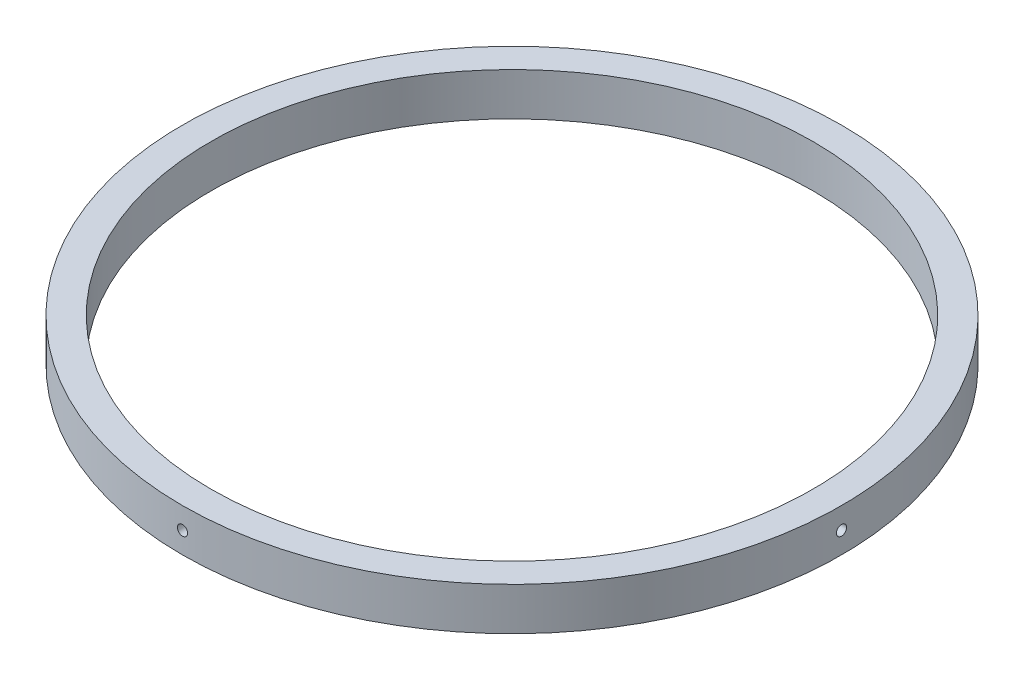
ISO-10303-21;
HEADER;
FILE_DESCRIPTION(('STEP AP214'),'2;1');
FILE_NAME('part.step','',(''),(''),'','','');
FILE_SCHEMA(('AUTOMOTIVE_DESIGN { 1 0 10303 214 1 1 1 1 }'));
ENDSEC;
DATA;
#1=APPLICATION_CONTEXT('core data for automotive mechanical design processes');
#2=APPLICATION_PROTOCOL_DEFINITION('international standard','automotive_design',2000,#1);
#3=PRODUCT_CONTEXT('',#1,'mechanical');
#4=PRODUCT('Part','Part','',(#3));
#5=PRODUCT_RELATED_PRODUCT_CATEGORY('part','',(#4));
#6=PRODUCT_DEFINITION_FORMATION('','',#4);
#7=PRODUCT_DEFINITION_CONTEXT('part definition',#1,'design');
#8=PRODUCT_DEFINITION('design','',#6,#7);
#9=PRODUCT_DEFINITION_SHAPE('','',#8);
#10=(LENGTH_UNIT() NAMED_UNIT(*) SI_UNIT(.MILLI.,.METRE.));
#11=(NAMED_UNIT(*) PLANE_ANGLE_UNIT() SI_UNIT($,.RADIAN.));
#12=(NAMED_UNIT(*) SI_UNIT($,.STERADIAN.) SOLID_ANGLE_UNIT());
#13=UNCERTAINTY_MEASURE_WITH_UNIT(LENGTH_MEASURE(1.E-05),#10,'distance_accuracy_value','');
#14=(GEOMETRIC_REPRESENTATION_CONTEXT(3) GLOBAL_UNCERTAINTY_ASSIGNED_CONTEXT((#13)) GLOBAL_UNIT_ASSIGNED_CONTEXT((#10,
#11,#12)) REPRESENTATION_CONTEXT('',''));
#15=CARTESIAN_POINT('',(0.,0.,0.));
#16=DIRECTION('',(0.,0.,1.));
#17=DIRECTION('',(1.,0.,0.));
#18=AXIS2_PLACEMENT_3D('',#15,#16,#17);
#19=CARTESIAN_POINT('',(0.,9.525,0.));
#20=DIRECTION('',(0.,1.,0.));
#21=DIRECTION('',(0.,0.,1.));
#22=AXIS2_PLACEMENT_3D('',#19,#20,#21);
#23=PLANE('',#22);
#24=CARTESIAN_POINT('',(0.,9.525,0.));
#25=DIRECTION('',(0.,1.,0.));
#26=DIRECTION('',(0.,0.,1.));
#27=AXIS2_PLACEMENT_3D('',#24,#25,#26);
#28=CIRCLE('',#27,73.4441);
#29=CARTESIAN_POINT('',(0.,9.525,73.4441));
#30=VERTEX_POINT('',#29);
#31=EDGE_CURVE('E92',#30,#30,#28,.T.);
#32=ORIENTED_EDGE('',*,*,#31,.T.);
#33=EDGE_LOOP('',(#32));
#34=FACE_BOUND('',#33,.T.);
#35=CARTESIAN_POINT('',(0.,9.525,0.));
#36=DIRECTION('',(0.,1.,0.));
#37=DIRECTION('',(0.,0.,1.));
#38=AXIS2_PLACEMENT_3D('',#35,#36,#37);
#39=CIRCLE('',#38,67.0941);
#40=CARTESIAN_POINT('',(0.,9.525,67.0941));
#41=VERTEX_POINT('',#40);
#42=EDGE_CURVE('E86',#41,#41,#39,.T.);
#43=ORIENTED_EDGE('',*,*,#42,.F.);
#44=EDGE_LOOP('',(#43));
#45=FACE_BOUND('',#44,.T.);
#46=ADVANCED_FACE('F39',(#34,#45),#23,.T.);
#47=CARTESIAN_POINT('',(0.,0.,0.));
#48=DIRECTION('',(0.,1.,0.));
#49=DIRECTION('',(0.,0.,1.));
#50=AXIS2_PLACEMENT_3D('',#47,#48,#49);
#51=PLANE('',#50);
#52=CARTESIAN_POINT('',(0.,0.,0.));
#53=DIRECTION('',(0.,1.,0.));
#54=DIRECTION('',(0.,0.,1.));
#55=AXIS2_PLACEMENT_3D('',#52,#53,#54);
#56=CIRCLE('',#55,73.4441);
#57=CARTESIAN_POINT('',(0.,0.,73.4441));
#58=VERTEX_POINT('',#57);
#59=EDGE_CURVE('E89',#58,#58,#56,.T.);
#60=ORIENTED_EDGE('',*,*,#59,.F.);
#61=EDGE_LOOP('',(#60));
#62=FACE_BOUND('',#61,.T.);
#63=CARTESIAN_POINT('',(0.,0.,0.));
#64=DIRECTION('',(0.,1.,0.));
#65=DIRECTION('',(0.,0.,1.));
#66=AXIS2_PLACEMENT_3D('',#63,#64,#65);
#67=CIRCLE('',#66,67.0941);
#68=CARTESIAN_POINT('',(0.,0.,67.0941));
#69=VERTEX_POINT('',#68);
#70=EDGE_CURVE('E85',#69,#69,#67,.T.);
#71=ORIENTED_EDGE('',*,*,#70,.T.);
#72=EDGE_LOOP('',(#71));
#73=FACE_BOUND('',#72,.T.);
#74=ADVANCED_FACE('F125',(#62,#73),#51,.F.);
#75=CARTESIAN_POINT('',(0.,9.525,0.));
#76=DIRECTION('',(0.,-1.,0.));
#77=DIRECTION('',(0.,0.,-1.));
#78=AXIS2_PLACEMENT_3D('',#75,#76,#77);
#79=CYLINDRICAL_SURFACE('',#78,73.4441);
#80=CARTESIAN_POINT('',(-73.4354018625894,4.7625,1.13030000000078));
#81=CARTESIAN_POINT('',(-73.4354019801579,4.69901458651972,1.13029718596315));
#82=CARTESIAN_POINT('',(-73.4354850720725,4.6354832358144,1.12493338572669));
#83=CARTESIAN_POINT('',(-73.4358085508862,4.51017049763011,1.10361070993909));
#84=CARTESIAN_POINT('',(-73.4360491267305,4.44839130535626,1.08763910708523));
#85=CARTESIAN_POINT('',(-73.4366603140926,4.32841646745732,1.04555585678293));
#86=CARTESIAN_POINT('',(-73.4370308630958,4.27021911482614,1.01944908351396));
#87=CARTESIAN_POINT('',(-73.4378601629382,4.15904961042227,0.957843341357666));
#88=CARTESIAN_POINT('',(-73.4383188919431,4.10607617005962,0.922346696679069));
#89=CARTESIAN_POINT('',(-73.4392729885667,4.00682973275258,0.842958551923166));
#90=CARTESIAN_POINT('',(-73.4397683627153,3.96055793437489,0.799065553435194));
#91=CARTESIAN_POINT('',(-73.4407398570405,3.87603808252867,0.704132487369946));
#92=CARTESIAN_POINT('',(-73.4412159764575,3.83779034532365,0.653092138216334));
#93=CARTESIAN_POINT('',(-73.4420952797698,3.77040535740468,0.545312487094727));
#94=CARTESIAN_POINT('',(-73.4424984614061,3.74126838883155,0.488573008708898));
#95=CARTESIAN_POINT('',(-73.4431864140283,3.69293404932209,0.371007072132881));
#96=CARTESIAN_POINT('',(-73.4434711853145,3.67373665317547,0.310180624309143));
#97=CARTESIAN_POINT('',(-73.4438901938109,3.64582777953372,0.186172393768996));
#98=CARTESIAN_POINT('',(-73.444024442822,3.6371154800077,0.122990796096642));
#99=CARTESIAN_POINT('',(-73.4441273113106,3.63042159337373,-0.00393830791133251));
#100=CARTESIAN_POINT('',(-73.4440959311819,3.63243998074965,-0.0676858129009407));
#101=CARTESIAN_POINT('',(-73.4438710898859,3.64714943262573,-0.193931574711534));
#102=CARTESIAN_POINT('',(-73.4436776423955,3.65983959652571,-0.256429936493137));
#103=CARTESIAN_POINT('',(-73.4431504895987,3.69553098868454,-0.378409068670441));
#104=CARTESIAN_POINT('',(-73.4428167841019,3.71853223093914,-0.437889834970087));
#105=CARTESIAN_POINT('',(-73.4420467112114,3.77419388089606,-0.552148145860925));
#106=CARTESIAN_POINT('',(-73.4416103394308,3.80685470136849,-0.60692548933782));
#107=CARTESIAN_POINT('',(-73.4406841265387,3.8809080505612,-0.710219777631187));
#108=CARTESIAN_POINT('',(-73.4401942854111,3.92230058193067,-0.758736720548252));
#109=CARTESIAN_POINT('',(-73.4392162936752,4.0126474758912,-0.848138253185941));
#110=CARTESIAN_POINT('',(-73.4387281432477,4.06160262309102,-0.889022050007282));
#111=CARTESIAN_POINT('',(-73.4378086191264,4.1656822984193,-0.961990628246081));
#112=CARTESIAN_POINT('',(-73.4373772454405,4.22080682739936,-0.994075408448954));
#113=CARTESIAN_POINT('',(-73.4366199143113,4.33566087951367,-1.04853506769212));
#114=CARTESIAN_POINT('',(-73.4362939571252,4.39539041388169,-1.07090992304445));
#115=CARTESIAN_POINT('',(-73.4357842209197,4.5177587448084,-1.10531407920842));
#116=CARTESIAN_POINT('',(-73.4356004417935,4.58039753918602,-1.11734338777593));
#117=CARTESIAN_POINT('',(-73.4353958004301,4.70679938360949,-1.13071400840129));
#118=CARTESIAN_POINT('',(-73.4353749214772,4.77056231763144,-1.13205641707014));
#119=CARTESIAN_POINT('',(-73.4354983908623,4.897408459552,-1.12401798703634));
#120=CARTESIAN_POINT('',(-73.4356427391554,4.96049166763512,-1.11463715124461));
#121=CARTESIAN_POINT('',(-73.4360803741533,5.08418457025441,-1.0854194316129));
#122=CARTESIAN_POINT('',(-73.4363736537852,5.14479438210764,-1.06558304431866));
#123=CARTESIAN_POINT('',(-73.4370760812918,5.2618235606404,-1.01601782112557));
#124=CARTESIAN_POINT('',(-73.4374852292167,5.31824292549907,-0.986288980928208));
#125=CARTESIAN_POINT('',(-73.438373307211,5.42529469537495,-0.91777993235607));
#126=CARTESIAN_POINT('',(-73.4388522429726,5.47592662772493,-0.878998985469532));
#127=CARTESIAN_POINT('',(-73.4398258816708,5.56996152045131,-0.79348766641494));
#128=CARTESIAN_POINT('',(-73.4403205846227,5.61336447382199,-0.74675728654304));
#129=CARTESIAN_POINT('',(-73.4412700338129,5.69171297463476,-0.646668935945548));
#130=CARTESIAN_POINT('',(-73.4417247767014,5.72665781347698,-0.593310410496608));
#131=CARTESIAN_POINT('',(-73.4425429909772,5.78709324327675,-0.48148333448776));
#132=CARTESIAN_POINT('',(-73.4429064624897,5.81258384720281,-0.423014790937476));
#133=CARTESIAN_POINT('',(-73.4435011413697,5.85338600005109,-0.30263007616752));
#134=CARTESIAN_POINT('',(-73.4437323547517,5.86869801184836,-0.24071406186159));
#135=CARTESIAN_POINT('',(-73.4440364749234,5.88870985409385,-0.115189689282051));
#136=CARTESIAN_POINT('',(-73.4441093815392,5.89340967289439,-0.0515813291510426));
#137=CARTESIAN_POINT('',(-73.4440886686332,5.89206362858367,0.0755148484988024));
#138=CARTESIAN_POINT('',(-73.4439950666139,5.88601889488939,0.139002677985024));
#139=CARTESIAN_POINT('',(-73.4436519218355,5.86335762970601,0.264062374866338));
#140=CARTESIAN_POINT('',(-73.4434023787638,5.84674107702916,0.325634238421243));
#141=CARTESIAN_POINT('',(-73.4427754744884,5.8034077312098,0.445115333648111));
#142=CARTESIAN_POINT('',(-73.442398110939,5.77669075271219,0.503024498082319));
#143=CARTESIAN_POINT('',(-73.441558118179,5.71391618551283,0.613533482685314));
#144=CARTESIAN_POINT('',(-73.4410954922469,5.67785895593682,0.666133506878582));
#145=CARTESIAN_POINT('',(-73.4401371037506,5.59742731765538,0.764534281421184));
#146=CARTESIAN_POINT('',(-73.4396413412298,5.5530529198491,0.810335040680406));
#147=CARTESIAN_POINT('',(-73.4386724342655,5.45723178341596,0.893848549832328));
#148=CARTESIAN_POINT('',(-73.4381992954687,5.4057832914551,0.931559288639813));
#149=CARTESIAN_POINT('',(-73.4373288868319,5.29726252625202,0.99782413991892));
#150=CARTESIAN_POINT('',(-73.4369316567407,5.24018733022912,1.02637346039838));
#151=CARTESIAN_POINT('',(-73.436258658972,5.12209794465957,1.07345170964634));
#152=CARTESIAN_POINT('',(-73.4359827459596,5.06108856923416,1.09199263432517));
#153=CARTESIAN_POINT('',(-73.435657537867,4.96015939423846,1.11359358991764));
#154=CARTESIAN_POINT('',(-73.4355620735965,4.92089522916826,1.11985065811409));
#155=CARTESIAN_POINT('',(-73.4354341991793,4.84192670404707,1.12820474335819));
#156=CARTESIAN_POINT('',(-73.4354017890276,4.80222234402964,1.13030176072288));
#157=CARTESIAN_POINT('',(-73.4354018625894,4.7625,1.13030000000078));
#158=B_SPLINE_CURVE_WITH_KNOTS('',3,(#80,#81,#82,#83,#84,#85,#86,#87,#88,#89,#90,#91,#92,#93,
#94,#95,#96,#97,#98,#99,#100,#101,#102,#103,#104,#105,#106,#107,#108,#109,#110,#111,#112,#113,
#114,#115,#116,#117,#118,#119,#120,#121,#122,#123,#124,#125,#126,#127,#128,#129,#130,#131,#132,
#133,#134,#135,#136,#137,#138,#139,#140,#141,#142,#143,#144,#145,#146,#147,#148,#149,#150,#151,
#152,#153,#154,#155,#156,#157),.UNSPECIFIED.,.T.,.F.,(4,2,2,2,2,2,2,2,2,2,2,2,2,2,2,2,2,2,2,2,2,
2,2,2,2,2,2,2,2,2,2,2,2,2,2,2,2,2,4),(0.,0.190311252608483,0.380851255239351,0.571299737161708,
0.761701122751235,0.952136519065567,1.1425794198661,1.33302821768753,1.52347653246075,
1.71390991512572,1.90434284496583,2.09475970562358,2.28517682474441,2.47560208188629,
2.66602739680307,2.85647248131301,3.04691759211129,3.23736316750938,3.42780860013336,
3.61823449039673,3.80866032896731,3.99907712481837,4.18949400341023,4.3799264225045,
4.57035902614908,4.76080757824755,4.95125586910392,5.14169549866449,5.33213533724667,
5.52255515886996,5.71297536212886,5.90339906000008,6.09381543730756,6.28423156508752,
6.47469497339717,6.66525784415163,6.85559179912226,6.97466812249377,7.09374443679038),.UNSPECIFIED.);
#159=CARTESIAN_POINT('',(-73.4354018625894,4.7625,1.13030000000078));
#160=VERTEX_POINT('',#159);
#161=EDGE_CURVE('E11',#160,#160,#158,.T.);
#162=ORIENTED_EDGE('',*,*,#161,.T.);
#163=EDGE_LOOP('',(#162));
#164=FACE_BOUND('',#163,.T.);
#165=CARTESIAN_POINT('',(0.,5.89279999999999,-73.4441));
#166=CARTESIAN_POINT('',(-0.0634854139824358,5.89279718596282,-73.4440998824902));
#167=CARTESIAN_POINT('',(-0.127016765188211,5.88743338564437,-73.444016800727));
#168=CARTESIAN_POINT('',(-0.252329504412168,5.86611070950154,-73.4436933580055));
#169=CARTESIAN_POINT('',(-0.314108697225617,5.85013910637613,-73.4434528081211));
#170=CARTESIAN_POINT('',(-0.434083536265221,5.80805585527926,-73.4428416771784));
#171=CARTESIAN_POINT('',(-0.492280889492904,5.78194908147429,-73.4424711586324));
#172=CARTESIAN_POINT('',(-0.60345039489422,5.72034333805618,-73.441641910788));
#173=CARTESIAN_POINT('',(-0.65642383565857,5.68484669265311,-73.441183203326));
#174=CARTESIAN_POINT('',(-0.755670272504042,5.60545854716865,-73.4402291314938));
#175=CARTESIAN_POINT('',(-0.801942070147607,5.56156554883812,-73.439733760591));
#176=CARTESIAN_POINT('',(-0.886461920579129,5.46663248339507,-73.4387622529833));
#177=CARTESIAN_POINT('',(-0.924709657101328,5.41559213470422,-73.438286117037));
#178=CARTESIAN_POINT('',(-0.992094644312481,5.30781248398011,-73.4374067681724));
#179=CARTESIAN_POINT('',(-1.0212316127335,5.25107300544953,-73.4370035575136));
#180=CARTESIAN_POINT('',(-1.06956595192165,5.13350706855879,-73.4363155470407));
#181=CARTESIAN_POINT('',(-1.08876334790094,5.07268062056585,-73.4360307469263));
#182=CARTESIAN_POINT('',(-1.11667222118385,4.9486723895397,-73.4356116936424));
#183=CARTESIAN_POINT('',(-1.12538452050688,4.88549079154797,-73.4354774286713));
#184=CARTESIAN_POINT('',(-1.13207840662425,4.75856168691704,-73.4353745480875));
#185=CARTESIAN_POINT('',(-1.13006001893684,4.69481418162397,-73.4354059320811));
#186=CARTESIAN_POINT('',(-1.11535056657432,4.56856842120511,-73.4356307992727));
#187=CARTESIAN_POINT('',(-1.10266040281276,4.50607006108216,-73.4358242687874));
#188=CARTESIAN_POINT('',(-1.06696901150831,4.38409093215086,-73.4363514741018));
#189=CARTESIAN_POINT('',(-1.0439677699666,4.32461016743946,-73.4366852100918));
#190=CARTESIAN_POINT('',(-0.988306121471859,4.21035185844783,-73.4374553391207));
#191=CARTESIAN_POINT('',(-0.955645301580094,4.15557451536406,-73.4378917365482));
#192=CARTESIAN_POINT('',(-0.881591953619187,4.05228022760927,-73.4388179846059));
#193=CARTESIAN_POINT('',(-0.840199422901237,4.00376328483739,-73.4393078352525));
#194=CARTESIAN_POINT('',(-0.749852529394727,3.91436175143873,-73.4402858257731));
#195=CARTESIAN_POINT('',(-0.700897381866501,3.87347795384349,-73.4407739654643));
#196=CARTESIAN_POINT('',(-0.596817705608302,3.80050937420089,-73.441693452515));
#197=CARTESIAN_POINT('',(-0.54169317602781,3.76842459336657,-73.4421247998668));
#198=CARTESIAN_POINT('',(-0.426839123768411,3.71396493367206,-73.4428820743007));
#199=CARTESIAN_POINT('',(-0.367109589949629,3.69159007830183,-73.4432080011278));
#200=CARTESIAN_POINT('',(-0.24474126021403,3.65718592193298,-73.44371768587));
#201=CARTESIAN_POINT('',(-0.182102466477367,3.64515661318171,-73.4439014438916));
#202=CARTESIAN_POINT('',(-0.0557006223239076,3.63178599186623,-73.4441060615927));
#203=CARTESIAN_POINT('',(0.00806231208755234,3.6304435828664,-73.4441269379833));
#204=CARTESIAN_POINT('',(0.134908454867238,3.63848201237734,-73.4440034830954));
#205=CARTESIAN_POINT('',(0.19799166341998,3.64786284797715,-73.4438591518618));
#206=CARTESIAN_POINT('',(0.321684568233357,3.67708056769072,-73.4434215631614));
#207=CARTESIAN_POINT('',(0.382294381765213,3.69691695545275,-73.4431283127643));
#208=CARTESIAN_POINT('',(0.499323563447404,3.74648218014529,-73.4424259430563));
#209=CARTESIAN_POINT('',(0.55574292977803,3.77621102137158,-73.4420168236952));
#210=CARTESIAN_POINT('',(0.662794700613425,3.84472007143342,-73.4411287896939));
#211=CARTESIAN_POINT('',(0.713426632618569,3.88350101851881,-73.4406498693621));
#212=CARTESIAN_POINT('',(0.807461524556138,3.96901233777799,-73.4396762415781));
#213=CARTESIAN_POINT('',(0.850864477481374,4.01574271765723,-73.4391815341104));
#214=CARTESIAN_POINT('',(0.929212977393419,4.11583106805158,-73.4382320579577));
#215=CARTESIAN_POINT('',(0.964157815779815,4.16918959329044,-73.437777292621));
#216=CARTESIAN_POINT('',(1.02459324477839,4.28101666876331,-73.436959025317));
#217=CARTESIAN_POINT('',(1.0500838483591,4.3394852119877,-73.4365955232246));
#218=CARTESIAN_POINT('',(1.09088600096491,4.45986992701356,-73.4360007884904));
#219=CARTESIAN_POINT('',(1.10619801271589,4.52178594195186,-73.4357695498361));
#220=CARTESIAN_POINT('',(1.1262098546543,4.64731031586004,-73.4354653954722));
#221=CARTESIAN_POINT('',(1.13090967319738,4.71091867668679,-73.4353924799364));
#222=CARTESIAN_POINT('',(1.12956362816224,4.83801485384465,-73.4354131953028));
#223=CARTESIAN_POINT('',(1.12351889430615,4.90150268214639,-73.4355068086955));
#224=CARTESIAN_POINT('',(1.10085762921712,5.02656237661998,-73.435849991488));
#225=CARTESIAN_POINT('',(1.08424107679427,5.08813423895127,-73.4360995612004));
#226=CARTESIAN_POINT('',(1.04090773191501,5.20761533181967,-73.4367265223904));
#227=CARTESIAN_POINT('',(1.01419075410094,5.2655244951181,-73.4371039162138));
#228=CARTESIAN_POINT('',(0.95141618861796,5.37603347773681,-73.4379439598428));
#229=CARTESIAN_POINT('',(0.915358960073569,5.42863350108086,-73.4384066063703));
#230=CARTESIAN_POINT('',(0.834927322897371,5.52703427574332,-73.4393650174109));
#231=CARTESIAN_POINT('',(0.790552924930953,5.57283503578051,-73.4398607818815));
#232=CARTESIAN_POINT('',(0.694731787861533,5.65634854642698,-73.4408296731935));
#233=CARTESIAN_POINT('',(0.643283295426185,5.69405928595303,-73.4413027943834));
#234=CARTESIAN_POINT('',(0.534762529867057,5.76032413797214,-73.4421731560186));
#235=CARTESIAN_POINT('',(0.477687334046741,5.7888734586111,-73.4425703567102));
#236=CARTESIAN_POINT('',(0.359597948912069,5.83595170821415,-73.4432432967205));
#237=CARTESIAN_POINT('',(0.298588573717871,5.85449263308599,-73.4435191813728));
#238=CARTESIAN_POINT('',(0.197659398202872,5.87609358924315,-73.443844354306));
#239=CARTESIAN_POINT('',(0.158395232342233,5.88235065769298,-73.4439398076798));
#240=CARTESIAN_POINT('',(0.0794267056360334,5.89070474327386,-73.4440676672869));
#241=CARTESIAN_POINT('',(0.0397223448240084,5.89280176072183,-73.444100073525));
#242=CARTESIAN_POINT('',(0.,5.89279999999999,-73.4441));
#243=B_SPLINE_CURVE_WITH_KNOTS('',3,(#165,#166,#167,#168,#169,#170,#171,#172,#173,#174,#175,
#176,#177,#178,#179,#180,#181,#182,#183,#184,#185,#186,#187,#188,#189,#190,#191,#192,#193,#194,
#195,#196,#197,#198,#199,#200,#201,#202,#203,#204,#205,#206,#207,#208,#209,#210,#211,#212,#213,
#214,#215,#216,#217,#218,#219,#220,#221,#222,#223,#224,#225,#226,#227,#228,#229,#230,#231,#232,
#233,#234,#235,#236,#237,#238,#239,#240,#241,#242),.UNSPECIFIED.,.T.,.F.,(4,2,2,2,2,2,2,2,2,2,2,
2,2,2,2,2,2,2,2,2,2,2,2,2,2,2,2,2,2,2,2,2,2,2,2,2,2,2,4),(0.,0.190311254116423,
0.380851258222507,0.571299741864933,0.761701129148031,0.952136523490114,1.14257942237169,
1.33302822093132,1.52347653640715,1.71390991998338,1.90434285069699,2.09475970663659,
2.285176821096,2.47560207690133,2.66602739047323,2.85647247693613,3.04691758965408,
3.23736316308849,3.42780859380821,3.61823448529272,3.80866032508363,3.99907712568838,
4.18949400898146,4.37992642726549,4.57035903013827,4.76080758147686,4.95125587157305,
5.14169550316485,5.33213534371834,5.52255516190442,5.71297536176457,5.90339905628498,
6.09381543026629,6.2842315600719,6.47469497036059,6.66525784022832,6.85559179436237,
6.97466812011322,7.09374443679272),.UNSPECIFIED.);
#244=CARTESIAN_POINT('',(0.,5.89279999999999,-73.4441));
#245=VERTEX_POINT('',#244);
#246=EDGE_CURVE('E52',#245,#245,#243,.T.);
#247=ORIENTED_EDGE('',*,*,#246,.T.);
#248=EDGE_LOOP('',(#247));
#249=FACE_BOUND('',#248,.T.);
#250=CARTESIAN_POINT('',(73.4354018625894,4.7625,-1.13030000000026));
#251=CARTESIAN_POINT('',(73.4354019801579,4.69901458651972,-1.13029718596264));
#252=CARTESIAN_POINT('',(73.4354850720725,4.6354832358144,-1.12493338572617));
#253=CARTESIAN_POINT('',(73.4358085508862,4.51017049763011,-1.10361070993858));
#254=CARTESIAN_POINT('',(73.4360491267305,4.44839130535626,-1.08763910708471));
#255=CARTESIAN_POINT('',(73.4366603140926,4.32841646745732,-1.04555585678241));
#256=CARTESIAN_POINT('',(73.4370308630958,4.27021911482614,-1.01944908351345));
#257=CARTESIAN_POINT('',(73.4378601629382,4.15904961042227,-0.957843341357153));
#258=CARTESIAN_POINT('',(73.4383188919431,4.10607617005962,-0.922346696678556));
#259=CARTESIAN_POINT('',(73.4392729885667,4.00682973275258,-0.842958551922653));
#260=CARTESIAN_POINT('',(73.4397683627153,3.96055793437489,-0.799065553434681));
#261=CARTESIAN_POINT('',(73.4407398570405,3.87603808252867,-0.704132487369433));
#262=CARTESIAN_POINT('',(73.4412159764575,3.83779034532365,-0.653092138215821));
#263=CARTESIAN_POINT('',(73.4420952797698,3.77040535740468,-0.545312487094214));
#264=CARTESIAN_POINT('',(73.4424984614061,3.74126838883155,-0.488573008708385));
#265=CARTESIAN_POINT('',(73.4431864140283,3.69293404932209,-0.371007072132368));
#266=CARTESIAN_POINT('',(73.4434711853145,3.67373665317547,-0.31018062430863));
#267=CARTESIAN_POINT('',(73.4438901938109,3.64582777953372,-0.186172393768483));
#268=CARTESIAN_POINT('',(73.444024442822,3.6371154800077,-0.122990796096129));
#269=CARTESIAN_POINT('',(73.4441273113106,3.63042159337373,0.00393830791184544));
#270=CARTESIAN_POINT('',(73.4440959311819,3.63243998074965,0.0676858129014536));
#271=CARTESIAN_POINT('',(73.4438710898859,3.64714943262573,0.193931574712047));
#272=CARTESIAN_POINT('',(73.4436776423955,3.65983959652571,0.25642993649365));
#273=CARTESIAN_POINT('',(73.4431504895987,3.69553098868454,0.378409068670953));
#274=CARTESIAN_POINT('',(73.4428167841019,3.71853223093914,0.4378898349706));
#275=CARTESIAN_POINT('',(73.4420467112114,3.77419388089606,0.552148145861438));
#276=CARTESIAN_POINT('',(73.4416103394308,3.80685470136849,0.606925489338333));
#277=CARTESIAN_POINT('',(73.4406841265387,3.8809080505612,0.7102197776317));
#278=CARTESIAN_POINT('',(73.4401942854111,3.92230058193067,0.758736720548765));
#279=CARTESIAN_POINT('',(73.4392162936752,4.0126474758912,0.848138253186454));
#280=CARTESIAN_POINT('',(73.4387281432477,4.06160262309102,0.889022050007795));
#281=CARTESIAN_POINT('',(73.4378086191264,4.1656822984193,0.961990628246594));
#282=CARTESIAN_POINT('',(73.4373772454405,4.22080682739936,0.994075408449467));
#283=CARTESIAN_POINT('',(73.4366199143113,4.33566087951367,1.04853506769263));
#284=CARTESIAN_POINT('',(73.4362939571252,4.39539041388169,1.07090992304497));
#285=CARTESIAN_POINT('',(73.4357842209196,4.5177587448084,1.10531407920893));
#286=CARTESIAN_POINT('',(73.4356004417935,4.58039753918602,1.11734338777645));
#287=CARTESIAN_POINT('',(73.4353958004301,4.70679938360949,1.1307140084018));
#288=CARTESIAN_POINT('',(73.4353749214772,4.77056231763144,1.13205641707065));
#289=CARTESIAN_POINT('',(73.4354983908623,4.897408459552,1.12401798703686));
#290=CARTESIAN_POINT('',(73.4356427391554,4.96049166763512,1.11463715124513));
#291=CARTESIAN_POINT('',(73.4360803741533,5.08418457025441,1.08541943161341));
#292=CARTESIAN_POINT('',(73.4363736537852,5.14479438210764,1.06558304431917));
#293=CARTESIAN_POINT('',(73.4370760812917,5.2618235606404,1.01601782112608));
#294=CARTESIAN_POINT('',(73.4374852292167,5.31824292549907,0.986288980928721));
#295=CARTESIAN_POINT('',(73.438373307211,5.42529469537495,0.917779932356583));
#296=CARTESIAN_POINT('',(73.4388522429726,5.47592662772493,0.878998985470045));
#297=CARTESIAN_POINT('',(73.4398258816708,5.56996152045132,0.793487666415453));
#298=CARTESIAN_POINT('',(73.4403205846227,5.61336447382199,0.746757286543553));
#299=CARTESIAN_POINT('',(73.4412700338129,5.69171297463476,0.64666893594606));
#300=CARTESIAN_POINT('',(73.4417247767014,5.72665781347698,0.593310410497121));
#301=CARTESIAN_POINT('',(73.4425429909772,5.78709324327675,0.481483334488272));
#302=CARTESIAN_POINT('',(73.4429064624897,5.81258384720281,0.423014790937988));
#303=CARTESIAN_POINT('',(73.4435011413697,5.85338600005109,0.302630076168033));
#304=CARTESIAN_POINT('',(73.4437323547517,5.86869801184836,0.240714061862103));
#305=CARTESIAN_POINT('',(73.4440364749234,5.88870985409385,0.115189689282563));
#306=CARTESIAN_POINT('',(73.4441093815392,5.89340967289439,0.0515813291515551));
#307=CARTESIAN_POINT('',(73.4440886686332,5.89206362858367,-0.0755148484982899));
#308=CARTESIAN_POINT('',(73.4439950666139,5.88601889488939,-0.139002677984511));
#309=CARTESIAN_POINT('',(73.4436519218355,5.86335762970601,-0.264062374865825));
#310=CARTESIAN_POINT('',(73.4434023787638,5.84674107702916,-0.32563423842073));
#311=CARTESIAN_POINT('',(73.4427754744884,5.8034077312098,-0.445115333647599));
#312=CARTESIAN_POINT('',(73.442398110939,5.77669075271219,-0.503024498081806));
#313=CARTESIAN_POINT('',(73.441558118179,5.71391618551283,-0.613533482684802));
#314=CARTESIAN_POINT('',(73.4410954922469,5.67785895593682,-0.666133506878069));
#315=CARTESIAN_POINT('',(73.4401371037506,5.59742731765538,-0.764534281420671));
#316=CARTESIAN_POINT('',(73.4396413412298,5.5530529198491,-0.810335040679893));
#317=CARTESIAN_POINT('',(73.4386724342655,5.45723178341596,-0.893848549831815));
#318=CARTESIAN_POINT('',(73.4381992954687,5.4057832914551,-0.9315592886393));
#319=CARTESIAN_POINT('',(73.4373288868319,5.29726252625202,-0.997824139918407));
#320=CARTESIAN_POINT('',(73.4369316567407,5.24018733022912,-1.02637346039787));
#321=CARTESIAN_POINT('',(73.436258658972,5.12209794465957,-1.07345170964582));
#322=CARTESIAN_POINT('',(73.4359827459596,5.06108856923416,-1.09199263432465));
#323=CARTESIAN_POINT('',(73.435657537867,4.96015939423846,-1.11359358991712));
#324=CARTESIAN_POINT('',(73.4355620735965,4.92089522916826,-1.11985065811358));
#325=CARTESIAN_POINT('',(73.4354341991793,4.84192670404707,-1.12820474335768));
#326=CARTESIAN_POINT('',(73.4354017890276,4.80222234402964,-1.13030176072237));
#327=CARTESIAN_POINT('',(73.4354018625894,4.7625,-1.13030000000026));
#328=B_SPLINE_CURVE_WITH_KNOTS('',3,(#250,#251,#252,#253,#254,#255,#256,#257,#258,#259,#260,
#261,#262,#263,#264,#265,#266,#267,#268,#269,#270,#271,#272,#273,#274,#275,#276,#277,#278,#279,
#280,#281,#282,#283,#284,#285,#286,#287,#288,#289,#290,#291,#292,#293,#294,#295,#296,#297,#298,
#299,#300,#301,#302,#303,#304,#305,#306,#307,#308,#309,#310,#311,#312,#313,#314,#315,#316,#317,
#318,#319,#320,#321,#322,#323,#324,#325,#326,#327),.UNSPECIFIED.,.T.,.F.,(4,2,2,2,2,2,2,2,2,2,2,
2,2,2,2,2,2,2,2,2,2,2,2,2,2,2,2,2,2,2,2,2,2,2,2,2,2,2,4),(0.,0.190311252608483,
0.380851255239351,0.571299737161708,0.761701122751235,0.952136519065567,1.1425794198661,
1.33302821768753,1.52347653246075,1.71390991512572,1.90434284496583,2.09475970562358,
2.28517682474441,2.47560208188628,2.66602739680307,2.85647248131301,3.04691759211129,
3.23736316750938,3.42780860013336,3.61823449039673,3.80866032896731,3.99907712481837,
4.18949400341023,4.3799264225045,4.57035902614908,4.76080757824755,4.95125586910392,
5.14169549866449,5.33213533724667,5.52255515886996,5.71297536212886,5.90339906000009,
6.09381543730756,6.28423156508752,6.47469497339717,6.66525784415163,6.85559179912227,
6.97466812249377,7.09374443679038),.UNSPECIFIED.);
#329=CARTESIAN_POINT('',(73.4354018625894,4.7625,-1.13030000000026));
#330=VERTEX_POINT('',#329);
#331=EDGE_CURVE('E104',#330,#330,#328,.T.);
#332=ORIENTED_EDGE('',*,*,#331,.T.);
#333=EDGE_LOOP('',(#332));
#334=FACE_BOUND('',#333,.T.);
#335=CARTESIAN_POINT('',(1.13030000000001,4.7625,73.4354018625894));
#336=CARTESIAN_POINT('',(1.13029718596238,4.69901458651972,73.4354019801579));
#337=CARTESIAN_POINT('',(1.12493338572592,4.6354832358144,73.4354850720725));
#338=CARTESIAN_POINT('',(1.10361070993832,4.51017049763011,73.4358085508862));
#339=CARTESIAN_POINT('',(1.08763910708446,4.44839130535626,73.4360491267305));
#340=CARTESIAN_POINT('',(1.04555585678216,4.32841646745732,73.4366603140926));
#341=CARTESIAN_POINT('',(1.01944908351319,4.27021911482614,73.4370308630958));
#342=CARTESIAN_POINT('',(0.957843341356896,4.15904961042227,73.4378601629382));
#343=CARTESIAN_POINT('',(0.922346696678299,4.10607617005962,73.4383188919431));
#344=CARTESIAN_POINT('',(0.842958551922396,4.00682973275258,73.4392729885667));
#345=CARTESIAN_POINT('',(0.799065553434424,3.96055793437489,73.4397683627153));
#346=CARTESIAN_POINT('',(0.704132487369176,3.87603808252867,73.4407398570405));
#347=CARTESIAN_POINT('',(0.653092138215564,3.83779034532365,73.4412159764575));
#348=CARTESIAN_POINT('',(0.545312487093957,3.77040535740468,73.4420952797698));
#349=CARTESIAN_POINT('',(0.488573008708128,3.74126838883155,73.4424984614061));
#350=CARTESIAN_POINT('',(0.371007072132111,3.69293404932209,73.4431864140283));
#351=CARTESIAN_POINT('',(0.310180624308373,3.67373665317547,73.4434711853145));
#352=CARTESIAN_POINT('',(0.186172393768226,3.64582777953372,73.4438901938109));
#353=CARTESIAN_POINT('',(0.122990796095872,3.6371154800077,73.444024442822));
#354=CARTESIAN_POINT('',(-0.00393830791210214,3.63042159337373,73.4441273113106));
#355=CARTESIAN_POINT('',(-0.0676858129017103,3.63243998074965,73.4440959311819));
#356=CARTESIAN_POINT('',(-0.193931574712304,3.64714943262573,73.4438710898859));
#357=CARTESIAN_POINT('',(-0.256429936493906,3.65983959652571,73.4436776423955));
#358=CARTESIAN_POINT('',(-0.37840906867121,3.69553098868454,73.4431504895987));
#359=CARTESIAN_POINT('',(-0.437889834970857,3.71853223093914,73.4428167841019));
#360=CARTESIAN_POINT('',(-0.552148145861694,3.77419388089606,73.4420467112114));
#361=CARTESIAN_POINT('',(-0.606925489338589,3.80685470136849,73.4416103394308));
#362=CARTESIAN_POINT('',(-0.710219777631956,3.8809080505612,73.4406841265387));
#363=CARTESIAN_POINT('',(-0.758736720549021,3.92230058193067,73.4401942854111));
#364=CARTESIAN_POINT('',(-0.84813825318671,4.0126474758912,73.4392162936752));
#365=CARTESIAN_POINT('',(-0.889022050008052,4.06160262309102,73.4387281432477));
#366=CARTESIAN_POINT('',(-0.961990628246851,4.1656822984193,73.4378086191264));
#367=CARTESIAN_POINT('',(-0.994075408449724,4.22080682739936,73.4373772454405));
#368=CARTESIAN_POINT('',(-1.04853506769288,4.33566087951367,73.4366199143113));
#369=CARTESIAN_POINT('',(-1.07090992304522,4.39539041388169,73.4362939571252));
#370=CARTESIAN_POINT('',(-1.10531407920919,4.5177587448084,73.4357842209196));
#371=CARTESIAN_POINT('',(-1.1173433877767,4.58039753918602,73.4356004417935));
#372=CARTESIAN_POINT('',(-1.13071400840206,4.70679938360949,73.4353958004301));
#373=CARTESIAN_POINT('',(-1.13205641707091,4.77056231763144,73.4353749214772));
#374=CARTESIAN_POINT('',(-1.12401798703711,4.897408459552,73.4354983908623));
#375=CARTESIAN_POINT('',(-1.11463715124538,4.96049166763512,73.4356427391554));
#376=CARTESIAN_POINT('',(-1.08541943161367,5.08418457025441,73.4360803741533));
#377=CARTESIAN_POINT('',(-1.06558304431943,5.14479438210764,73.4363736537852));
#378=CARTESIAN_POINT('',(-1.01601782112633,5.2618235606404,73.4370760812917));
#379=CARTESIAN_POINT('',(-0.986288980928977,5.31824292549907,73.4374852292167));
#380=CARTESIAN_POINT('',(-0.917779932356839,5.42529469537495,73.438373307211));
#381=CARTESIAN_POINT('',(-0.878998985470301,5.47592662772493,73.4388522429726));
#382=CARTESIAN_POINT('',(-0.79348766641571,5.56996152045132,73.4398258816708));
#383=CARTESIAN_POINT('',(-0.74675728654381,5.61336447382199,73.4403205846227));
#384=CARTESIAN_POINT('',(-0.646668935946317,5.69171297463476,73.4412700338129));
#385=CARTESIAN_POINT('',(-0.593310410497377,5.72665781347698,73.4417247767014));
#386=CARTESIAN_POINT('',(-0.481483334488529,5.78709324327675,73.4425429909772));
#387=CARTESIAN_POINT('',(-0.423014790938245,5.81258384720281,73.4429064624897));
#388=CARTESIAN_POINT('',(-0.302630076168289,5.85338600005109,73.4435011413697));
#389=CARTESIAN_POINT('',(-0.240714061862359,5.86869801184836,73.4437323547517));
#390=CARTESIAN_POINT('',(-0.11518968928282,5.88870985409385,73.4440364749234));
#391=CARTESIAN_POINT('',(-0.0515813291518117,5.89340967289439,73.4441093815392));
#392=CARTESIAN_POINT('',(0.0755148484980336,5.89206362858367,73.4440886686332));
#393=CARTESIAN_POINT('',(0.139002677984255,5.88601889488939,73.4439950666139));
#394=CARTESIAN_POINT('',(0.264062374865569,5.86335762970601,73.4436519218355));
#395=CARTESIAN_POINT('',(0.325634238420474,5.84674107702916,73.4434023787638));
#396=CARTESIAN_POINT('',(0.445115333647343,5.8034077312098,73.4427754744884));
#397=CARTESIAN_POINT('',(0.503024498081549,5.77669075271219,73.442398110939));
#398=CARTESIAN_POINT('',(0.613533482684545,5.71391618551283,73.441558118179));
#399=CARTESIAN_POINT('',(0.666133506877813,5.67785895593682,73.4410954922469));
#400=CARTESIAN_POINT('',(0.764534281420415,5.59742731765538,73.4401371037506));
#401=CARTESIAN_POINT('',(0.810335040679637,5.5530529198491,73.4396413412298));
#402=CARTESIAN_POINT('',(0.893848549831559,5.45723178341596,73.4386724342655));
#403=CARTESIAN_POINT('',(0.931559288639044,5.40578329145509,73.4381992954687));
#404=CARTESIAN_POINT('',(0.997824139918151,5.29726252625202,73.4373288868319));
#405=CARTESIAN_POINT('',(1.02637346039762,5.24018733022912,73.4369316567407));
#406=CARTESIAN_POINT('',(1.07345170964557,5.12209794465957,73.436258658972));
#407=CARTESIAN_POINT('',(1.0919926343244,5.06108856923416,73.4359827459596));
#408=CARTESIAN_POINT('',(1.11359358991687,4.96015939423846,73.435657537867));
#409=CARTESIAN_POINT('',(1.11985065811332,4.92089522916826,73.4355620735965));
#410=CARTESIAN_POINT('',(1.12820474335742,4.84192670404707,73.4354341991793));
#411=CARTESIAN_POINT('',(1.13030176072211,4.80222234402964,73.4354017890276));
#412=CARTESIAN_POINT('',(1.13030000000001,4.7625,73.4354018625894));
#413=B_SPLINE_CURVE_WITH_KNOTS('',3,(#335,#336,#337,#338,#339,#340,#341,#342,#343,#344,#345,
#346,#347,#348,#349,#350,#351,#352,#353,#354,#355,#356,#357,#358,#359,#360,#361,#362,#363,#364,
#365,#366,#367,#368,#369,#370,#371,#372,#373,#374,#375,#376,#377,#378,#379,#380,#381,#382,#383,
#384,#385,#386,#387,#388,#389,#390,#391,#392,#393,#394,#395,#396,#397,#398,#399,#400,#401,#402,
#403,#404,#405,#406,#407,#408,#409,#410,#411,#412),.UNSPECIFIED.,.T.,.F.,(4,2,2,2,2,2,2,2,2,2,2,
2,2,2,2,2,2,2,2,2,2,2,2,2,2,2,2,2,2,2,2,2,2,2,2,2,2,2,4),(0.,0.190311252608483,
0.380851255239351,0.571299737161708,0.761701122751235,0.952136519065568,1.1425794198661,
1.33302821768753,1.52347653246075,1.71390991512572,1.90434284496583,2.09475970562358,
2.28517682474441,2.47560208188628,2.66602739680307,2.85647248131301,3.04691759211129,
3.23736316750938,3.42780860013336,3.61823449039673,3.80866032896731,3.99907712481837,
4.18949400341023,4.3799264225045,4.57035902614908,4.76080757824755,4.95125586910392,
5.14169549866449,5.33213533724667,5.52255515886996,5.71297536212886,5.90339906000008,
6.09381543730756,6.28423156508751,6.47469497339717,6.66525784415163,6.85559179912227,
6.97466812249377,7.09374443679037),.UNSPECIFIED.);
#414=CARTESIAN_POINT('',(1.13030000000001,4.7625,73.4354018625894));
#415=VERTEX_POINT('',#414);
#416=EDGE_CURVE('E95',#415,#415,#413,.T.);
#417=ORIENTED_EDGE('',*,*,#416,.T.);
#418=EDGE_LOOP('',(#417));
#419=FACE_BOUND('',#418,.T.);
#420=ORIENTED_EDGE('',*,*,#31,.F.);
#421=EDGE_LOOP('',(#420));
#422=FACE_BOUND('',#421,.T.);
#423=ORIENTED_EDGE('',*,*,#59,.T.);
#424=EDGE_LOOP('',(#423));
#425=FACE_BOUND('',#424,.T.);
#426=ADVANCED_FACE('F41',(#164,#249,#334,#419,#422,#425),#79,.T.);
#427=CARTESIAN_POINT('',(0.,9.525,0.));
#428=DIRECTION('',(0.,-1.,0.));
#429=DIRECTION('',(0.,0.,-1.));
#430=AXIS2_PLACEMENT_3D('',#427,#428,#429);
#431=CYLINDRICAL_SURFACE('',#430,67.0941);
#432=ORIENTED_EDGE('',*,*,#42,.T.);
#433=EDGE_LOOP('',(#432));
#434=FACE_BOUND('',#433,.T.);
#435=ORIENTED_EDGE('',*,*,#70,.F.);
#436=EDGE_LOOP('',(#435));
#437=FACE_BOUND('',#436,.T.);
#438=ADVANCED_FACE('F115',(#434,#437),#431,.F.);
#439=CARTESIAN_POINT('',(0.,4.7625,73.4441));
#440=DIRECTION('',(0.,0.,1.));
#441=DIRECTION('',(1.,0.,0.));
#442=AXIS2_PLACEMENT_3D('',#439,#440,#441);
#443=CYLINDRICAL_SURFACE('',#442,1.13029999999999);
#444=CARTESIAN_POINT('',(0.,4.7625,68.6816));
#445=DIRECTION('',(0.,0.,1.));
#446=DIRECTION('',(1.,0.,0.));
#447=AXIS2_PLACEMENT_3D('',#444,#445,#446);
#448=CIRCLE('',#447,1.1303);
#449=CARTESIAN_POINT('',(1.13030000000001,4.7625,68.6816));
#450=VERTEX_POINT('',#449);
#451=EDGE_CURVE('E82',#450,#450,#448,.T.);
#452=ORIENTED_EDGE('',*,*,#451,.F.);
#453=EDGE_LOOP('',(#452));
#454=FACE_BOUND('',#453,.T.);
#455=ORIENTED_EDGE('',*,*,#416,.F.);
#456=EDGE_LOOP('',(#455));
#457=FACE_BOUND('',#456,.T.);
#458=ADVANCED_FACE('F109',(#454,#457),#443,.F.);
#459=CARTESIAN_POINT('',(0.,4.7625,68.6816));
#460=DIRECTION('',(0.,0.,1.));
#461=DIRECTION('',(1.,0.,0.));
#462=AXIS2_PLACEMENT_3D('',#459,#460,#461);
#463=CONICAL_SURFACE('',#462,1.1303,1.02974425867666);
#464=CARTESIAN_POINT('',(0.,4.7625,68.0024472423131));
#465=VERTEX_POINT('',#464);
#466=VERTEX_LOOP('',#465);
#467=FACE_BOUND('',#466,.T.);
#468=ORIENTED_EDGE('',*,*,#451,.T.);
#469=EDGE_LOOP('',(#468));
#470=FACE_BOUND('',#469,.T.);
#471=ADVANCED_FACE('F114',(#467,#470),#463,.F.);
#472=CARTESIAN_POINT('',(73.4441,4.7625,-2.70306492405943E-13));
#473=DIRECTION('',(1.,0.,0.));
#474=DIRECTION('',(0.,0.,-1.));
#475=AXIS2_PLACEMENT_3D('',#472,#473,#474);
#476=CYLINDRICAL_SURFACE('',#475,1.13029999999999);
#477=CARTESIAN_POINT('',(68.6816,4.7625,-2.53678312529703E-13));
#478=DIRECTION('',(1.,0.,0.));
#479=DIRECTION('',(0.,0.,-1.));
#480=AXIS2_PLACEMENT_3D('',#477,#478,#479);
#481=CIRCLE('',#480,1.1303);
#482=CARTESIAN_POINT('',(68.6816,4.7625,-1.13030000000025));
#483=VERTEX_POINT('',#482);
#484=EDGE_CURVE('E77',#483,#483,#481,.T.);
#485=ORIENTED_EDGE('',*,*,#484,.F.);
#486=EDGE_LOOP('',(#485));
#487=FACE_BOUND('',#486,.T.);
#488=ORIENTED_EDGE('',*,*,#331,.F.);
#489=EDGE_LOOP('',(#488));
#490=FACE_BOUND('',#489,.T.);
#491=ADVANCED_FACE('F120',(#487,#490),#476,.F.);
#492=CARTESIAN_POINT('',(68.6816,4.7625,-2.53678312529703E-13));
#493=DIRECTION('',(1.,0.,0.));
#494=DIRECTION('',(0.,0.,-1.));
#495=AXIS2_PLACEMENT_3D('',#492,#493,#494);
#496=CONICAL_SURFACE('',#495,1.1303,1.02974425867666);
#497=CARTESIAN_POINT('',(68.0024472423131,4.7625,-2.51307063350015E-13));
#498=VERTEX_POINT('',#497);
#499=VERTEX_LOOP('',#498);
#500=FACE_BOUND('',#499,.T.);
#501=ORIENTED_EDGE('',*,*,#484,.T.);
#502=EDGE_LOOP('',(#501));
#503=FACE_BOUND('',#502,.T.);
#504=ADVANCED_FACE('F117',(#500,#503),#496,.F.);
#505=CARTESIAN_POINT('',(0.,4.7625,-73.4441));
#506=DIRECTION('',(0.,0.,-1.));
#507=DIRECTION('',(-1.,0.,0.));
#508=AXIS2_PLACEMENT_3D('',#505,#506,#507);
#509=CYLINDRICAL_SURFACE('',#508,1.13029999999999);
#510=CARTESIAN_POINT('',(0.,4.7625,-68.6816));
#511=DIRECTION('',(0.,0.,-1.));
#512=DIRECTION('',(-1.,0.,0.));
#513=AXIS2_PLACEMENT_3D('',#510,#511,#512);
#514=CIRCLE('',#513,1.1303);
#515=CARTESIAN_POINT('',(-1.13030000000001,4.7625,-68.6816));
#516=VERTEX_POINT('',#515);
#517=EDGE_CURVE('E74',#516,#516,#514,.T.);
#518=ORIENTED_EDGE('',*,*,#517,.F.);
#519=EDGE_LOOP('',(#518));
#520=FACE_BOUND('',#519,.T.);
#521=ORIENTED_EDGE('',*,*,#246,.F.);
#522=EDGE_LOOP('',(#521));
#523=FACE_BOUND('',#522,.T.);
#524=ADVANCED_FACE('F160',(#520,#523),#509,.F.);
#525=CARTESIAN_POINT('',(0.,4.7625,-68.6816));
#526=DIRECTION('',(0.,0.,-1.));
#527=DIRECTION('',(-1.,0.,0.));
#528=AXIS2_PLACEMENT_3D('',#525,#526,#527);
#529=CONICAL_SURFACE('',#528,1.1303,1.02974425867666);
#530=CARTESIAN_POINT('',(0.,4.7625,-68.0024472423131));
#531=VERTEX_POINT('',#530);
#532=VERTEX_LOOP('',#531);
#533=FACE_BOUND('',#532,.T.);
#534=ORIENTED_EDGE('',*,*,#517,.T.);
#535=EDGE_LOOP('',(#534));
#536=FACE_BOUND('',#535,.T.);
#537=ADVANCED_FACE('F164',(#533,#536),#529,.F.);
#538=CARTESIAN_POINT('',(-73.4441,4.7625,7.83163901602201E-13));
#539=DIRECTION('',(-1.,0.,0.));
#540=DIRECTION('',(0.,0.,1.));
#541=AXIS2_PLACEMENT_3D('',#538,#539,#540);
#542=CYLINDRICAL_SURFACE('',#541,1.13029999999999);
#543=CARTESIAN_POINT('',(-68.6816,4.7625,7.3327936197348E-13));
#544=DIRECTION('',(-1.,0.,0.));
#545=DIRECTION('',(0.,0.,1.));
#546=AXIS2_PLACEMENT_3D('',#543,#544,#545);
#547=CIRCLE('',#546,1.1303);
#548=CARTESIAN_POINT('',(-68.6816,4.7625,1.13030000000073));
#549=VERTEX_POINT('',#548);
#550=EDGE_CURVE('E72',#549,#549,#547,.T.);
#551=ORIENTED_EDGE('',*,*,#550,.F.);
#552=EDGE_LOOP('',(#551));
#553=FACE_BOUND('',#552,.T.);
#554=ORIENTED_EDGE('',*,*,#161,.F.);
#555=EDGE_LOOP('',(#554));
#556=FACE_BOUND('',#555,.T.);
#557=ADVANCED_FACE('F68',(#553,#556),#542,.F.);
#558=CARTESIAN_POINT('',(-68.6816,4.7625,7.3327936197348E-13));
#559=DIRECTION('',(-1.,0.,0.));
#560=DIRECTION('',(0.,0.,1.));
#561=AXIS2_PLACEMENT_3D('',#558,#559,#560);
#562=CONICAL_SURFACE('',#561,1.1303,1.02974425867666);
#563=CARTESIAN_POINT('',(-68.0024472423131,4.7625,7.26165614434418E-13));
#564=VERTEX_POINT('',#563);
#565=VERTEX_LOOP('',#564);
#566=FACE_BOUND('',#565,.T.);
#567=ORIENTED_EDGE('',*,*,#550,.T.);
#568=EDGE_LOOP('',(#567));
#569=FACE_BOUND('',#568,.T.);
#570=ADVANCED_FACE('F65',(#566,#569),#562,.F.);
#571=CLOSED_SHELL('',(#46,#74,#426,#438,#458,#471,#491,#504,#524,#537,#557,#570));
#572=MANIFOLD_SOLID_BREP('B2',#571);
#573=ADVANCED_BREP_SHAPE_REPRESENTATION('',(#18,#572),#14);
#574=SHAPE_DEFINITION_REPRESENTATION(#9,#573);
ENDSEC;
END-ISO-10303-21;
